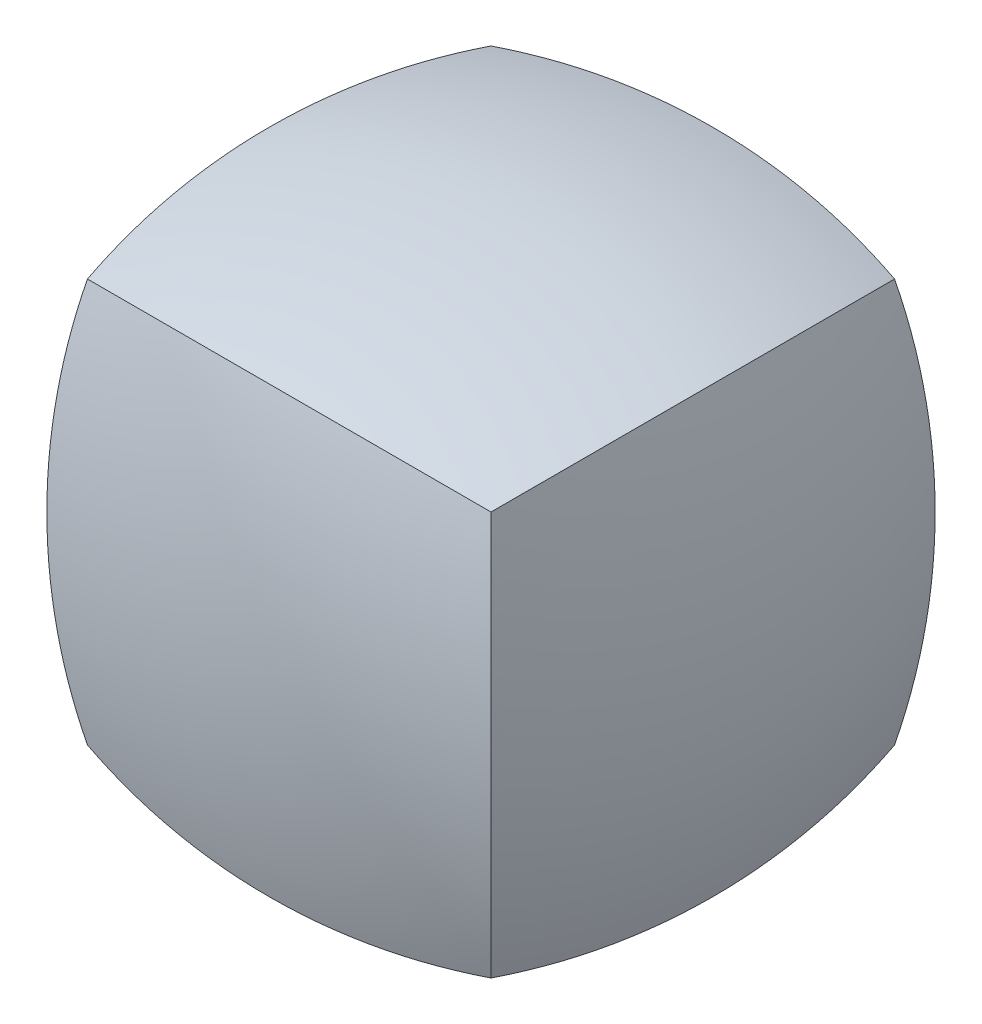
ISO-10303-21;
HEADER;
FILE_DESCRIPTION(('STEP AP214'),'2;1');
FILE_NAME('part.step','',(''),(''),'','','');
FILE_SCHEMA(('AUTOMOTIVE_DESIGN { 1 0 10303 214 1 1 1 1 }'));
ENDSEC;
DATA;
#1=APPLICATION_CONTEXT('core data for automotive mechanical design processes');
#2=APPLICATION_PROTOCOL_DEFINITION('international standard','automotive_design',2000,#1);
#3=PRODUCT_CONTEXT('',#1,'mechanical');
#4=PRODUCT('Part','Part','',(#3));
#5=PRODUCT_RELATED_PRODUCT_CATEGORY('part','',(#4));
#6=PRODUCT_DEFINITION_FORMATION('','',#4);
#7=PRODUCT_DEFINITION_CONTEXT('part definition',#1,'design');
#8=PRODUCT_DEFINITION('design','',#6,#7);
#9=PRODUCT_DEFINITION_SHAPE('','',#8);
#10=(LENGTH_UNIT() NAMED_UNIT(*) SI_UNIT(.MILLI.,.METRE.));
#11=(NAMED_UNIT(*) PLANE_ANGLE_UNIT() SI_UNIT($,.RADIAN.));
#12=(NAMED_UNIT(*) SI_UNIT($,.STERADIAN.) SOLID_ANGLE_UNIT());
#13=UNCERTAINTY_MEASURE_WITH_UNIT(LENGTH_MEASURE(1.E-05),#10,'distance_accuracy_value','');
#14=(GEOMETRIC_REPRESENTATION_CONTEXT(3) GLOBAL_UNCERTAINTY_ASSIGNED_CONTEXT((#13)) GLOBAL_UNIT_ASSIGNED_CONTEXT((#10,
#11,#12)) REPRESENTATION_CONTEXT('',''));
#15=CARTESIAN_POINT('',(0.,0.,0.));
#16=DIRECTION('',(0.,0.,1.));
#17=DIRECTION('',(1.,0.,0.));
#18=AXIS2_PLACEMENT_3D('',#15,#16,#17);
#19=CARTESIAN_POINT('',(0.,36.5124999999999,2.54965572445012E-13));
#20=DIRECTION('',(0.,-1.,0.));
#21=DIRECTION('',(-1.,0.,0.));
#22=AXIS2_PLACEMENT_3D('',#19,#20,#21);
#23=SPHERICAL_SURFACE('',#22,52.3874999999999);
#24=CARTESIAN_POINT('',(0.,18.25625,-18.2562499999998));
#25=DIRECTION('',(0.,0.707106781186544,0.707106781186551));
#26=DIRECTION('',(0.,-0.707106781186551,0.707106781186544));
#27=AXIS2_PLACEMENT_3D('',#24,#25,#26);
#28=CIRCLE('',#27,45.5836464987718);
#29=CARTESIAN_POINT('',(-12.7,-12.7000000000001,12.7));
#30=VERTEX_POINT('',#29);
#31=CARTESIAN_POINT('',(12.7000000000001,-12.7,12.6999999999999));
#32=VERTEX_POINT('',#31);
#33=EDGE_CURVE('E37',#30,#32,#28,.T.);
#34=ORIENTED_EDGE('',*,*,#33,.F.);
#35=CARTESIAN_POINT('',(18.25625,18.25625,1.27482786222506E-13));
#36=DIRECTION('',(-0.707106781186549,0.707106781186546,0.));
#37=DIRECTION('',(-0.707106781186546,-0.707106781186549,0.));
#38=AXIS2_PLACEMENT_3D('',#35,#36,#37);
#39=CIRCLE('',#38,45.5836464987719);
#40=CARTESIAN_POINT('',(-12.7,-12.6999999999999,-12.7000000000001));
#41=VERTEX_POINT('',#40);
#42=EDGE_CURVE('E75',#41,#30,#39,.T.);
#43=ORIENTED_EDGE('',*,*,#42,.F.);
#44=CARTESIAN_POINT('',(0.,18.2562499999998,18.2562500000001));
#45=DIRECTION('',(0.,0.707106781186554,-0.707106781186541));
#46=DIRECTION('',(0.,0.707106781186541,0.707106781186554));
#47=AXIS2_PLACEMENT_3D('',#44,#45,#46);
#48=CIRCLE('',#47,45.5836464987718);
#49=CARTESIAN_POINT('',(12.7000000000001,-12.6999999999998,-12.7000000000001));
#50=VERTEX_POINT('',#49);
#51=EDGE_CURVE('E69',#50,#41,#48,.T.);
#52=ORIENTED_EDGE('',*,*,#51,.F.);
#53=CARTESIAN_POINT('',(-18.25625,18.2562499999998,1.27482786222506E-13));
#54=DIRECTION('',(0.707106781186544,0.707106781186551,0.));
#55=DIRECTION('',(-0.707106781186551,0.707106781186544,0.));
#56=AXIS2_PLACEMENT_3D('',#53,#54,#55);
#57=CIRCLE('',#56,45.5836464987718);
#58=EDGE_CURVE('E78',#32,#50,#57,.T.);
#59=ORIENTED_EDGE('',*,*,#58,.F.);
#60=EDGE_LOOP('',(#34,#43,#52,#59));
#61=FACE_BOUND('',#60,.T.);
#62=ADVANCED_FACE('F34',(#61),#23,.T.);
#63=CARTESIAN_POINT('',(0.,1.27482786222506E-13,-36.5124999999999));
#64=DIRECTION('',(0.,0.,1.));
#65=DIRECTION('',(-1.,0.,0.));
#66=AXIS2_PLACEMENT_3D('',#63,#64,#65);
#67=SPHERICAL_SURFACE('',#66,52.3874999999999);
#68=ORIENTED_EDGE('',*,*,#33,.T.);
#69=CARTESIAN_POINT('',(-18.25625,-1.27482786222506E-13,-18.25625));
#70=DIRECTION('',(0.707106781186548,0.,-0.707106781186548));
#71=DIRECTION('',(-0.707106781186548,0.,-0.707106781186548));
#72=AXIS2_PLACEMENT_3D('',#69,#70,#71);
#73=CIRCLE('',#72,45.5836464987719);
#74=CARTESIAN_POINT('',(12.6999999999999,12.7,12.7000000000001));
#75=VERTEX_POINT('',#74);
#76=EDGE_CURVE('E92',#75,#32,#73,.T.);
#77=ORIENTED_EDGE('',*,*,#76,.F.);
#78=CARTESIAN_POINT('',(0.,-18.2562499999999,-18.25625));
#79=DIRECTION('',(0.,0.707106781186549,-0.707106781186546));
#80=DIRECTION('',(0.,0.707106781186546,0.707106781186549));
#81=AXIS2_PLACEMENT_3D('',#78,#79,#80);
#82=CIRCLE('',#81,45.5836464987718);
#83=CARTESIAN_POINT('',(-12.7,12.7,12.7));
#84=VERTEX_POINT('',#83);
#85=EDGE_CURVE('E51',#84,#75,#82,.T.);
#86=ORIENTED_EDGE('',*,*,#85,.F.);
#87=CARTESIAN_POINT('',(18.25625,1.27482786222506E-13,-18.25625));
#88=DIRECTION('',(-0.707106781186548,0.,-0.707106781186548));
#89=DIRECTION('',(-0.707106781186548,0.,0.707106781186548));
#90=AXIS2_PLACEMENT_3D('',#87,#88,#89);
#91=CIRCLE('',#90,45.5836464987719);
#92=EDGE_CURVE('E82',#30,#84,#91,.T.);
#93=ORIENTED_EDGE('',*,*,#92,.F.);
#94=EDGE_LOOP('',(#68,#77,#86,#93));
#95=FACE_BOUND('',#94,.T.);
#96=ADVANCED_FACE('F88',(#95),#67,.T.);
#97=CARTESIAN_POINT('',(36.5124999999999,1.27482786222506E-13,0.));
#98=DIRECTION('',(-1.,0.,0.));
#99=DIRECTION('',(0.,-1.,0.));
#100=AXIS2_PLACEMENT_3D('',#97,#98,#99);
#101=SPHERICAL_SURFACE('',#100,52.3874999999999);
#102=ORIENTED_EDGE('',*,*,#92,.T.);
#103=CARTESIAN_POINT('',(18.25625,-18.2562499999999,0.));
#104=DIRECTION('',(0.707106781186546,0.707106781186549,0.));
#105=DIRECTION('',(-0.707106781186549,0.707106781186546,0.));
#106=AXIS2_PLACEMENT_3D('',#103,#104,#105);
#107=CIRCLE('',#106,45.5836464987718);
#108=CARTESIAN_POINT('',(-12.7000000000001,12.7,-12.7));
#109=VERTEX_POINT('',#108);
#110=EDGE_CURVE('E100',#109,#84,#107,.T.);
#111=ORIENTED_EDGE('',*,*,#110,.F.);
#112=CARTESIAN_POINT('',(18.25625,-1.27482786222506E-13,18.25625));
#113=DIRECTION('',(0.707106781186548,0.,-0.707106781186548));
#114=DIRECTION('',(-0.707106781186548,0.,-0.707106781186548));
#115=AXIS2_PLACEMENT_3D('',#112,#113,#114);
#116=CIRCLE('',#115,45.5836464987719);
#117=EDGE_CURVE('E87',#41,#109,#116,.T.);
#118=ORIENTED_EDGE('',*,*,#117,.F.);
#119=ORIENTED_EDGE('',*,*,#42,.T.);
#120=EDGE_LOOP('',(#102,#111,#118,#119));
#121=FACE_BOUND('',#120,.T.);
#122=ADVANCED_FACE('F85',(#121),#101,.T.);
#123=CARTESIAN_POINT('',(0.,-3.82448358667518E-13,36.5124999999999));
#124=DIRECTION('',(0.,0.,-1.));
#125=DIRECTION('',(-1.,0.,0.));
#126=AXIS2_PLACEMENT_3D('',#123,#124,#125);
#127=SPHERICAL_SURFACE('',#126,52.3874999999999);
#128=ORIENTED_EDGE('',*,*,#51,.T.);
#129=ORIENTED_EDGE('',*,*,#117,.T.);
#130=CARTESIAN_POINT('',(0.,-18.2562500000001,18.25625));
#131=DIRECTION('',(0.,0.707106781186544,0.707106781186551));
#132=DIRECTION('',(0.,-0.707106781186551,0.707106781186544));
#133=AXIS2_PLACEMENT_3D('',#130,#131,#132);
#134=CIRCLE('',#133,45.5836464987719);
#135=CARTESIAN_POINT('',(12.7,12.7,-12.7));
#136=VERTEX_POINT('',#135);
#137=EDGE_CURVE('E43',#136,#109,#134,.T.);
#138=ORIENTED_EDGE('',*,*,#137,.F.);
#139=CARTESIAN_POINT('',(-18.25625,-3.82448358667518E-13,18.25625));
#140=DIRECTION('',(0.707106781186548,0.,0.707106781186548));
#141=DIRECTION('',(0.707106781186548,0.,-0.707106781186548));
#142=AXIS2_PLACEMENT_3D('',#139,#140,#141);
#143=CIRCLE('',#142,45.5836464987719);
#144=EDGE_CURVE('E95',#50,#136,#143,.T.);
#145=ORIENTED_EDGE('',*,*,#144,.F.);
#146=EDGE_LOOP('',(#128,#129,#138,#145));
#147=FACE_BOUND('',#146,.T.);
#148=ADVANCED_FACE('F105',(#147),#127,.T.);
#149=CARTESIAN_POINT('',(-36.5124999999999,-3.82448358667518E-13,0.));
#150=DIRECTION('',(1.,0.,0.));
#151=DIRECTION('',(0.,1.,0.));
#152=AXIS2_PLACEMENT_3D('',#149,#150,#151);
#153=SPHERICAL_SURFACE('',#152,52.3874999999999);
#154=ORIENTED_EDGE('',*,*,#76,.T.);
#155=ORIENTED_EDGE('',*,*,#58,.T.);
#156=ORIENTED_EDGE('',*,*,#144,.T.);
#157=CARTESIAN_POINT('',(-18.25625,-18.2562500000001,0.));
#158=DIRECTION('',(-0.707106781186551,0.707106781186544,0.));
#159=DIRECTION('',(-0.707106781186544,-0.707106781186551,0.));
#160=AXIS2_PLACEMENT_3D('',#157,#158,#159);
#161=CIRCLE('',#160,45.5836464987719);
#162=EDGE_CURVE('E11',#75,#136,#161,.T.);
#163=ORIENTED_EDGE('',*,*,#162,.F.);
#164=EDGE_LOOP('',(#154,#155,#156,#163));
#165=FACE_BOUND('',#164,.T.);
#166=ADVANCED_FACE('F108',(#165),#153,.T.);
#167=CARTESIAN_POINT('',(0.,-36.5124999999999,0.));
#168=DIRECTION('',(0.,1.,0.));
#169=DIRECTION('',(-1.,0.,0.));
#170=AXIS2_PLACEMENT_3D('',#167,#168,#169);
#171=SPHERICAL_SURFACE('',#170,52.3874999999999);
#172=ORIENTED_EDGE('',*,*,#85,.T.);
#173=ORIENTED_EDGE('',*,*,#162,.T.);
#174=ORIENTED_EDGE('',*,*,#137,.T.);
#175=ORIENTED_EDGE('',*,*,#110,.T.);
#176=EDGE_LOOP('',(#172,#173,#174,#175));
#177=FACE_BOUND('',#176,.T.);
#178=ADVANCED_FACE('F102',(#177),#171,.T.);
#179=CLOSED_SHELL('',(#62,#96,#122,#148,#166,#178));
#180=MANIFOLD_SOLID_BREP('B2',#179);
#181=ADVANCED_BREP_SHAPE_REPRESENTATION('',(#18,#180),#14);
#182=SHAPE_DEFINITION_REPRESENTATION(#9,#181);
ENDSEC;
END-ISO-10303-21;
